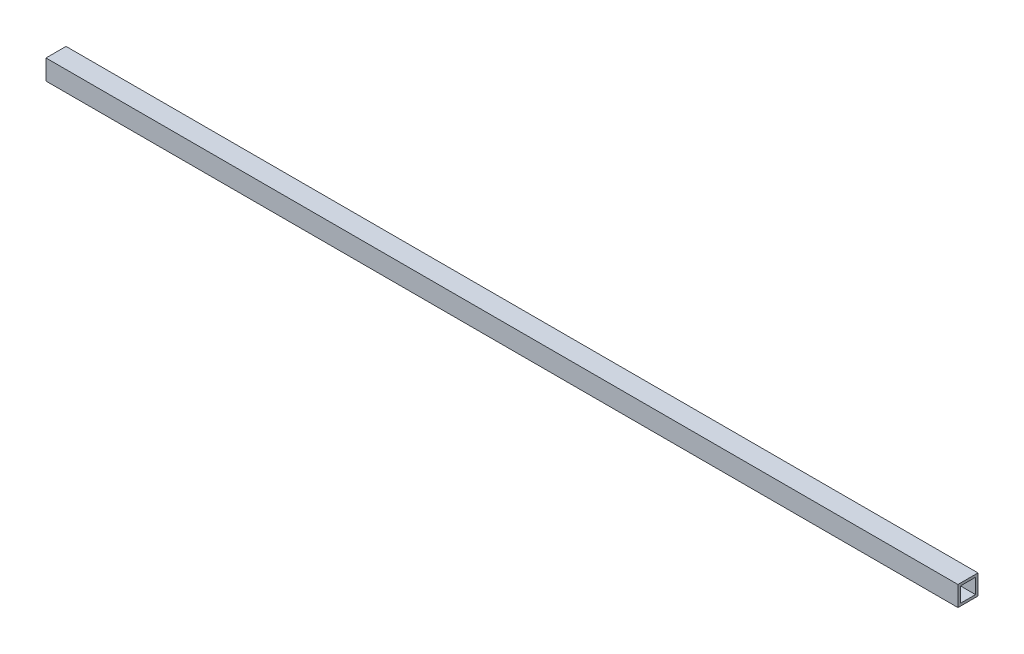
ISO-10303-21;
HEADER;
FILE_DESCRIPTION(('STEP AP214'),'2;1');
FILE_NAME('part.step','',(''),(''),'','','');
FILE_SCHEMA(('AUTOMOTIVE_DESIGN { 1 0 10303 214 1 1 1 1 }'));
ENDSEC;
DATA;
#1=APPLICATION_CONTEXT('core data for automotive mechanical design processes');
#2=APPLICATION_PROTOCOL_DEFINITION('international standard','automotive_design',2000,#1);
#3=PRODUCT_CONTEXT('',#1,'mechanical');
#4=PRODUCT('Part','Part','',(#3));
#5=PRODUCT_RELATED_PRODUCT_CATEGORY('part','',(#4));
#6=PRODUCT_DEFINITION_FORMATION('','',#4);
#7=PRODUCT_DEFINITION_CONTEXT('part definition',#1,'design');
#8=PRODUCT_DEFINITION('design','',#6,#7);
#9=PRODUCT_DEFINITION_SHAPE('','',#8);
#10=(LENGTH_UNIT() NAMED_UNIT(*) SI_UNIT(.MILLI.,.METRE.));
#11=(NAMED_UNIT(*) PLANE_ANGLE_UNIT() SI_UNIT($,.RADIAN.));
#12=(NAMED_UNIT(*) SI_UNIT($,.STERADIAN.) SOLID_ANGLE_UNIT());
#13=UNCERTAINTY_MEASURE_WITH_UNIT(LENGTH_MEASURE(1.E-05),#10,'distance_accuracy_value','');
#14=(GEOMETRIC_REPRESENTATION_CONTEXT(3) GLOBAL_UNCERTAINTY_ASSIGNED_CONTEXT((#13)) GLOBAL_UNIT_ASSIGNED_CONTEXT((#10,
#11,#12)) REPRESENTATION_CONTEXT('',''));
#15=CARTESIAN_POINT('',(0.,0.,0.));
#16=DIRECTION('',(0.,0.,1.));
#17=DIRECTION('',(1.,0.,0.));
#18=AXIS2_PLACEMENT_3D('',#15,#16,#17);
#19=CARTESIAN_POINT('',(910.,0.,0.));
#20=DIRECTION('',(1.,0.,0.));
#21=DIRECTION('',(0.,0.,-1.));
#22=AXIS2_PLACEMENT_3D('',#19,#20,#21);
#23=PLANE('',#22);
#24=DIRECTION('',(0.,0.,1.));
#25=VECTOR('',#24,1.);
#26=CARTESIAN_POINT('',(910.,20.,20.));
#27=LINE('',#26,#25);
#28=CARTESIAN_POINT('',(910.,20.,-20.));
#29=VERTEX_POINT('',#28);
#30=CARTESIAN_POINT('',(910.,20.,20.));
#31=VERTEX_POINT('',#30);
#32=EDGE_CURVE('E133',#29,#31,#27,.T.);
#33=ORIENTED_EDGE('',*,*,#32,.T.);
#34=DIRECTION('',(0.,-1.,0.));
#35=VECTOR('',#34,1.);
#36=CARTESIAN_POINT('',(910.,-20.,20.));
#37=LINE('',#36,#35);
#38=CARTESIAN_POINT('',(910.,-20.,20.));
#39=VERTEX_POINT('',#38);
#40=EDGE_CURVE('E136',#31,#39,#37,.T.);
#41=ORIENTED_EDGE('',*,*,#40,.T.);
#42=DIRECTION('',(0.,0.,-1.));
#43=VECTOR('',#42,1.);
#44=CARTESIAN_POINT('',(910.,-20.,20.));
#45=LINE('',#44,#43);
#46=CARTESIAN_POINT('',(910.,-20.,-20.));
#47=VERTEX_POINT('',#46);
#48=EDGE_CURVE('E139',#39,#47,#45,.T.);
#49=ORIENTED_EDGE('',*,*,#48,.T.);
#50=DIRECTION('',(0.,1.,0.));
#51=VECTOR('',#50,1.);
#52=CARTESIAN_POINT('',(910.,-20.,-20.));
#53=LINE('',#52,#51);
#54=EDGE_CURVE('E141',#47,#29,#53,.T.);
#55=ORIENTED_EDGE('',*,*,#54,.T.);
#56=EDGE_LOOP('',(#33,#41,#49,#55));
#57=FACE_BOUND('',#56,.T.);
#58=DIRECTION('',(0.,0.,-1.));
#59=VECTOR('',#58,1.);
#60=CARTESIAN_POINT('',(910.,-15.,15.));
#61=LINE('',#60,#59);
#62=CARTESIAN_POINT('',(910.,-15.,15.));
#63=VERTEX_POINT('',#62);
#64=CARTESIAN_POINT('',(910.,-15.,-15.));
#65=VERTEX_POINT('',#64);
#66=EDGE_CURVE('E105',#63,#65,#61,.T.);
#67=ORIENTED_EDGE('',*,*,#66,.F.);
#68=DIRECTION('',(0.,-1.,0.));
#69=VECTOR('',#68,1.);
#70=CARTESIAN_POINT('',(910.,-15.,15.));
#71=LINE('',#70,#69);
#72=CARTESIAN_POINT('',(910.,15.,15.));
#73=VERTEX_POINT('',#72);
#74=EDGE_CURVE('E97',#73,#63,#71,.T.);
#75=ORIENTED_EDGE('',*,*,#74,.F.);
#76=DIRECTION('',(0.,0.,1.));
#77=VECTOR('',#76,1.);
#78=CARTESIAN_POINT('',(910.,15.,15.));
#79=LINE('',#78,#77);
#80=CARTESIAN_POINT('',(910.,15.,-15.));
#81=VERTEX_POINT('',#80);
#82=EDGE_CURVE('E119',#81,#73,#79,.T.);
#83=ORIENTED_EDGE('',*,*,#82,.F.);
#84=DIRECTION('',(0.,1.,0.));
#85=VECTOR('',#84,1.);
#86=CARTESIAN_POINT('',(910.,-15.,-15.));
#87=LINE('',#86,#85);
#88=EDGE_CURVE('E117',#65,#81,#87,.T.);
#89=ORIENTED_EDGE('',*,*,#88,.F.);
#90=EDGE_LOOP('',(#67,#75,#83,#89));
#91=FACE_BOUND('',#90,.T.);
#92=ADVANCED_FACE('F32',(#57,#91),#23,.T.);
#93=CARTESIAN_POINT('',(-910.,0.,0.));
#94=DIRECTION('',(1.,0.,0.));
#95=DIRECTION('',(0.,0.,-1.));
#96=AXIS2_PLACEMENT_3D('',#93,#94,#95);
#97=PLANE('',#96);
#98=DIRECTION('',(0.,0.,1.));
#99=VECTOR('',#98,1.);
#100=CARTESIAN_POINT('',(-910.,20.,20.));
#101=LINE('',#100,#99);
#102=CARTESIAN_POINT('',(-910.,20.,-20.));
#103=VERTEX_POINT('',#102);
#104=CARTESIAN_POINT('',(-910.,20.,20.));
#105=VERTEX_POINT('',#104);
#106=EDGE_CURVE('E113',#103,#105,#101,.T.);
#107=ORIENTED_EDGE('',*,*,#106,.F.);
#108=DIRECTION('',(0.,1.,0.));
#109=VECTOR('',#108,1.);
#110=CARTESIAN_POINT('',(-910.,-20.,-20.));
#111=LINE('',#110,#109);
#112=CARTESIAN_POINT('',(-910.,-20.,-20.));
#113=VERTEX_POINT('',#112);
#114=EDGE_CURVE('E137',#113,#103,#111,.T.);
#115=ORIENTED_EDGE('',*,*,#114,.F.);
#116=DIRECTION('',(0.,0.,-1.));
#117=VECTOR('',#116,1.);
#118=CARTESIAN_POINT('',(-910.,-20.,20.));
#119=LINE('',#118,#117);
#120=CARTESIAN_POINT('',(-910.,-20.,20.));
#121=VERTEX_POINT('',#120);
#122=EDGE_CURVE('E148',#121,#113,#119,.T.);
#123=ORIENTED_EDGE('',*,*,#122,.F.);
#124=DIRECTION('',(0.,-1.,0.));
#125=VECTOR('',#124,1.);
#126=CARTESIAN_POINT('',(-910.,-20.,20.));
#127=LINE('',#126,#125);
#128=EDGE_CURVE('E146',#105,#121,#127,.T.);
#129=ORIENTED_EDGE('',*,*,#128,.F.);
#130=EDGE_LOOP('',(#107,#115,#123,#129));
#131=FACE_BOUND('',#130,.T.);
#132=DIRECTION('',(0.,-1.,0.));
#133=VECTOR('',#132,1.);
#134=CARTESIAN_POINT('',(-910.,-15.,15.));
#135=LINE('',#134,#133);
#136=CARTESIAN_POINT('',(-910.,15.,15.));
#137=VERTEX_POINT('',#136);
#138=CARTESIAN_POINT('',(-910.,-15.,15.));
#139=VERTEX_POINT('',#138);
#140=EDGE_CURVE('E55',#137,#139,#135,.T.);
#141=ORIENTED_EDGE('',*,*,#140,.T.);
#142=DIRECTION('',(0.,0.,-1.));
#143=VECTOR('',#142,1.);
#144=CARTESIAN_POINT('',(-910.,-15.,15.));
#145=LINE('',#144,#143);
#146=CARTESIAN_POINT('',(-910.,-15.,-15.));
#147=VERTEX_POINT('',#146);
#148=EDGE_CURVE('E112',#139,#147,#145,.T.);
#149=ORIENTED_EDGE('',*,*,#148,.T.);
#150=DIRECTION('',(0.,1.,0.));
#151=VECTOR('',#150,1.);
#152=CARTESIAN_POINT('',(-910.,-15.,-15.));
#153=LINE('',#152,#151);
#154=CARTESIAN_POINT('',(-910.,15.,-15.));
#155=VERTEX_POINT('',#154);
#156=EDGE_CURVE('E125',#147,#155,#153,.T.);
#157=ORIENTED_EDGE('',*,*,#156,.T.);
#158=DIRECTION('',(0.,0.,1.));
#159=VECTOR('',#158,1.);
#160=CARTESIAN_POINT('',(-910.,15.,15.));
#161=LINE('',#160,#159);
#162=EDGE_CURVE('E106',#155,#137,#161,.T.);
#163=ORIENTED_EDGE('',*,*,#162,.T.);
#164=EDGE_LOOP('',(#141,#149,#157,#163));
#165=FACE_BOUND('',#164,.T.);
#166=ADVANCED_FACE('F166',(#131,#165),#97,.F.);
#167=CARTESIAN_POINT('',(910.,20.,20.));
#168=DIRECTION('',(0.,-1.,0.));
#169=DIRECTION('',(0.,0.,-1.));
#170=AXIS2_PLACEMENT_3D('',#167,#168,#169);
#171=PLANE('',#170);
#172=ORIENTED_EDGE('',*,*,#106,.T.);
#173=DIRECTION('',(-1.,0.,0.));
#174=VECTOR('',#173,1.);
#175=CARTESIAN_POINT('',(910.,20.,20.));
#176=LINE('',#175,#174);
#177=EDGE_CURVE('E11',#31,#105,#176,.T.);
#178=ORIENTED_EDGE('',*,*,#177,.F.);
#179=ORIENTED_EDGE('',*,*,#32,.F.);
#180=DIRECTION('',(-1.,0.,0.));
#181=VECTOR('',#180,1.);
#182=CARTESIAN_POINT('',(910.,20.,-20.));
#183=LINE('',#182,#181);
#184=EDGE_CURVE('E143',#29,#103,#183,.T.);
#185=ORIENTED_EDGE('',*,*,#184,.T.);
#186=EDGE_LOOP('',(#172,#178,#179,#185));
#187=FACE_BOUND('',#186,.T.);
#188=ADVANCED_FACE('F34',(#187),#171,.F.);
#189=CARTESIAN_POINT('',(910.,-20.,20.));
#190=DIRECTION('',(0.,0.,-1.));
#191=DIRECTION('',(0.,1.,0.));
#192=AXIS2_PLACEMENT_3D('',#189,#190,#191);
#193=PLANE('',#192);
#194=ORIENTED_EDGE('',*,*,#128,.T.);
#195=DIRECTION('',(-1.,0.,0.));
#196=VECTOR('',#195,1.);
#197=CARTESIAN_POINT('',(910.,-20.,20.));
#198=LINE('',#197,#196);
#199=EDGE_CURVE('E40',#39,#121,#198,.T.);
#200=ORIENTED_EDGE('',*,*,#199,.F.);
#201=ORIENTED_EDGE('',*,*,#40,.F.);
#202=ORIENTED_EDGE('',*,*,#177,.T.);
#203=EDGE_LOOP('',(#194,#200,#201,#202));
#204=FACE_BOUND('',#203,.T.);
#205=ADVANCED_FACE('F176',(#204),#193,.F.);
#206=CARTESIAN_POINT('',(910.,-20.,20.));
#207=DIRECTION('',(0.,1.,0.));
#208=DIRECTION('',(0.,0.,1.));
#209=AXIS2_PLACEMENT_3D('',#206,#207,#208);
#210=PLANE('',#209);
#211=ORIENTED_EDGE('',*,*,#122,.T.);
#212=DIRECTION('',(-1.,0.,0.));
#213=VECTOR('',#212,1.);
#214=CARTESIAN_POINT('',(910.,-20.,-20.));
#215=LINE('',#214,#213);
#216=EDGE_CURVE('E153',#47,#113,#215,.T.);
#217=ORIENTED_EDGE('',*,*,#216,.F.);
#218=ORIENTED_EDGE('',*,*,#48,.F.);
#219=ORIENTED_EDGE('',*,*,#199,.T.);
#220=EDGE_LOOP('',(#211,#217,#218,#219));
#221=FACE_BOUND('',#220,.T.);
#222=ADVANCED_FACE('F160',(#221),#210,.F.);
#223=CARTESIAN_POINT('',(910.,-20.,-20.));
#224=DIRECTION('',(0.,0.,1.));
#225=DIRECTION('',(0.,-1.,0.));
#226=AXIS2_PLACEMENT_3D('',#223,#224,#225);
#227=PLANE('',#226);
#228=ORIENTED_EDGE('',*,*,#114,.T.);
#229=ORIENTED_EDGE('',*,*,#184,.F.);
#230=ORIENTED_EDGE('',*,*,#54,.F.);
#231=ORIENTED_EDGE('',*,*,#216,.T.);
#232=EDGE_LOOP('',(#228,#229,#230,#231));
#233=FACE_BOUND('',#232,.T.);
#234=ADVANCED_FACE('F170',(#233),#227,.F.);
#235=CARTESIAN_POINT('',(910.,-15.,15.));
#236=DIRECTION('',(0.,0.,-1.));
#237=DIRECTION('',(0.,1.,0.));
#238=AXIS2_PLACEMENT_3D('',#235,#236,#237);
#239=PLANE('',#238);
#240=ORIENTED_EDGE('',*,*,#140,.F.);
#241=DIRECTION('',(-1.,0.,0.));
#242=VECTOR('',#241,1.);
#243=CARTESIAN_POINT('',(910.,15.,15.));
#244=LINE('',#243,#242);
#245=EDGE_CURVE('E101',#73,#137,#244,.T.);
#246=ORIENTED_EDGE('',*,*,#245,.F.);
#247=ORIENTED_EDGE('',*,*,#74,.T.);
#248=DIRECTION('',(-1.,0.,0.));
#249=VECTOR('',#248,1.);
#250=CARTESIAN_POINT('',(910.,-15.,15.));
#251=LINE('',#250,#249);
#252=EDGE_CURVE('E100',#63,#139,#251,.T.);
#253=ORIENTED_EDGE('',*,*,#252,.T.);
#254=EDGE_LOOP('',(#240,#246,#247,#253));
#255=FACE_BOUND('',#254,.T.);
#256=ADVANCED_FACE('F99',(#255),#239,.T.);
#257=CARTESIAN_POINT('',(910.,-15.,15.));
#258=DIRECTION('',(0.,1.,0.));
#259=DIRECTION('',(0.,0.,1.));
#260=AXIS2_PLACEMENT_3D('',#257,#258,#259);
#261=PLANE('',#260);
#262=ORIENTED_EDGE('',*,*,#148,.F.);
#263=ORIENTED_EDGE('',*,*,#252,.F.);
#264=ORIENTED_EDGE('',*,*,#66,.T.);
#265=DIRECTION('',(-1.,0.,0.));
#266=VECTOR('',#265,1.);
#267=CARTESIAN_POINT('',(910.,-15.,-15.));
#268=LINE('',#267,#266);
#269=EDGE_CURVE('E114',#65,#147,#268,.T.);
#270=ORIENTED_EDGE('',*,*,#269,.T.);
#271=EDGE_LOOP('',(#262,#263,#264,#270));
#272=FACE_BOUND('',#271,.T.);
#273=ADVANCED_FACE('F109',(#272),#261,.T.);
#274=CARTESIAN_POINT('',(910.,-15.,-15.));
#275=DIRECTION('',(0.,0.,1.));
#276=DIRECTION('',(0.,-1.,0.));
#277=AXIS2_PLACEMENT_3D('',#274,#275,#276);
#278=PLANE('',#277);
#279=ORIENTED_EDGE('',*,*,#156,.F.);
#280=ORIENTED_EDGE('',*,*,#269,.F.);
#281=ORIENTED_EDGE('',*,*,#88,.T.);
#282=DIRECTION('',(-1.,0.,0.));
#283=VECTOR('',#282,1.);
#284=CARTESIAN_POINT('',(910.,15.,-15.));
#285=LINE('',#284,#283);
#286=EDGE_CURVE('E47',#81,#155,#285,.T.);
#287=ORIENTED_EDGE('',*,*,#286,.T.);
#288=EDGE_LOOP('',(#279,#280,#281,#287));
#289=FACE_BOUND('',#288,.T.);
#290=ADVANCED_FACE('F199',(#289),#278,.T.);
#291=CARTESIAN_POINT('',(910.,15.,15.));
#292=DIRECTION('',(0.,-1.,0.));
#293=DIRECTION('',(0.,0.,-1.));
#294=AXIS2_PLACEMENT_3D('',#291,#292,#293);
#295=PLANE('',#294);
#296=ORIENTED_EDGE('',*,*,#162,.F.);
#297=ORIENTED_EDGE('',*,*,#286,.F.);
#298=ORIENTED_EDGE('',*,*,#82,.T.);
#299=ORIENTED_EDGE('',*,*,#245,.T.);
#300=EDGE_LOOP('',(#296,#297,#298,#299));
#301=FACE_BOUND('',#300,.T.);
#302=ADVANCED_FACE('F203',(#301),#295,.T.);
#303=CLOSED_SHELL('',(#92,#166,#188,#205,#222,#234,#256,#273,#290,#302));
#304=MANIFOLD_SOLID_BREP('B2',#303);
#305=ADVANCED_BREP_SHAPE_REPRESENTATION('',(#18,#304),#14);
#306=SHAPE_DEFINITION_REPRESENTATION(#9,#305);
ENDSEC;
END-ISO-10303-21;
